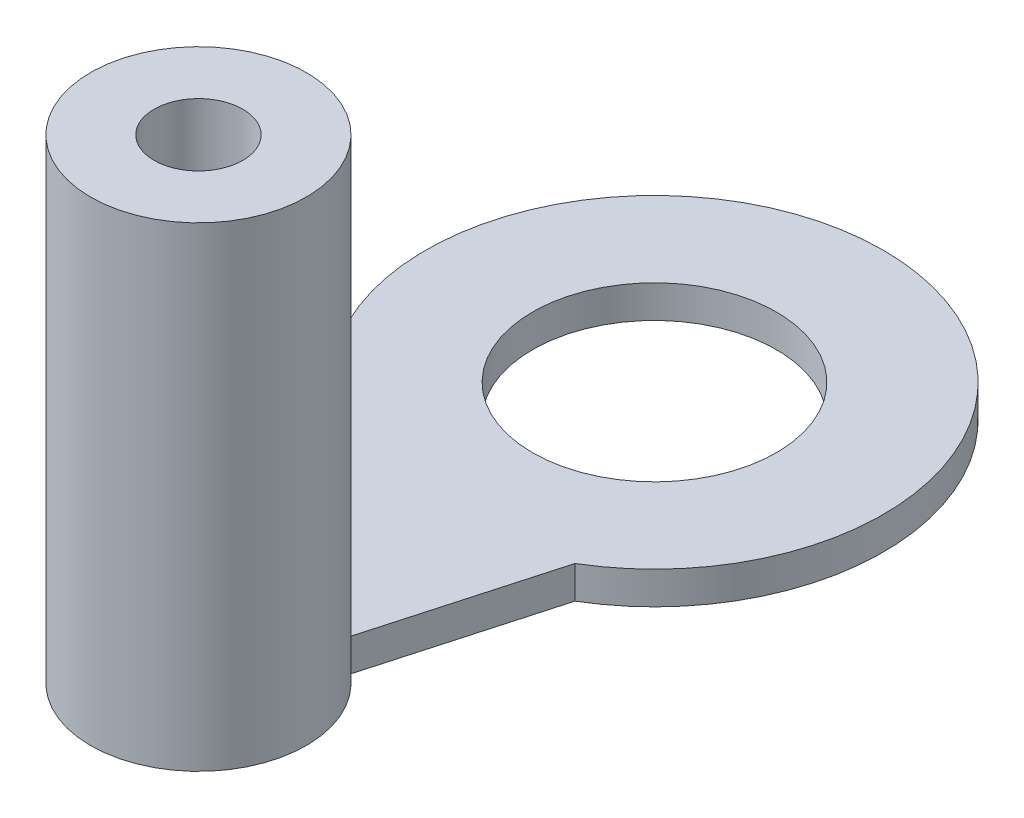
ISO-10303-21;
HEADER;
FILE_DESCRIPTION(('STEP AP214'),'2;1');
FILE_NAME('part.step','',(''),(''),'','','');
FILE_SCHEMA(('AUTOMOTIVE_DESIGN { 1 0 10303 214 1 1 1 1 }'));
ENDSEC;
DATA;
#1=APPLICATION_CONTEXT('core data for automotive mechanical design processes');
#2=APPLICATION_PROTOCOL_DEFINITION('international standard','automotive_design',2000,#1);
#3=PRODUCT_CONTEXT('',#1,'mechanical');
#4=PRODUCT('Part','Part','',(#3));
#5=PRODUCT_RELATED_PRODUCT_CATEGORY('part','',(#4));
#6=PRODUCT_DEFINITION_FORMATION('','',#4);
#7=PRODUCT_DEFINITION_CONTEXT('part definition',#1,'design');
#8=PRODUCT_DEFINITION('design','',#6,#7);
#9=PRODUCT_DEFINITION_SHAPE('','',#8);
#10=(LENGTH_UNIT() NAMED_UNIT(*) SI_UNIT(.MILLI.,.METRE.));
#11=(NAMED_UNIT(*) PLANE_ANGLE_UNIT() SI_UNIT($,.RADIAN.));
#12=(NAMED_UNIT(*) SI_UNIT($,.STERADIAN.) SOLID_ANGLE_UNIT());
#13=UNCERTAINTY_MEASURE_WITH_UNIT(LENGTH_MEASURE(1.E-05),#10,'distance_accuracy_value','');
#14=(GEOMETRIC_REPRESENTATION_CONTEXT(3) GLOBAL_UNCERTAINTY_ASSIGNED_CONTEXT((#13)) GLOBAL_UNIT_ASSIGNED_CONTEXT((#10,
#11,#12)) REPRESENTATION_CONTEXT('',''));
#15=CARTESIAN_POINT('',(0.,0.,0.));
#16=DIRECTION('',(0.,0.,1.));
#17=DIRECTION('',(1.,0.,0.));
#18=AXIS2_PLACEMENT_3D('',#15,#16,#17);
#19=CARTESIAN_POINT('',(0.,0.85,0.));
#20=DIRECTION('',(0.,-1.,0.));
#21=DIRECTION('',(0.,0.,-1.));
#22=AXIS2_PLACEMENT_3D('',#19,#20,#21);
#23=CYLINDRICAL_SURFACE('',#22,5.96);
#24=CARTESIAN_POINT('',(0.,0.,0.));
#25=DIRECTION('',(0.,1.,0.));
#26=DIRECTION('',(0.,0.,1.));
#27=AXIS2_PLACEMENT_3D('',#24,#25,#26);
#28=CIRCLE('',#27,5.96);
#29=CARTESIAN_POINT('',(3.04994252992994,0.,5.12049319539872));
#30=VERTEX_POINT('',#29);
#31=CARTESIAN_POINT('',(-3.03699348450103,0.,5.1281839451309));
#32=VERTEX_POINT('',#31);
#33=EDGE_CURVE('E95',#30,#32,#28,.T.);
#34=ORIENTED_EDGE('',*,*,#33,.T.);
#35=DIRECTION('',(0.,1.,0.));
#36=VECTOR('',#35,1.);
#37=CARTESIAN_POINT('',(-3.03699348450103,-9.09253277240075,5.1281839451309));
#38=LINE('',#37,#36);
#39=CARTESIAN_POINT('',(-3.03699348450103,0.85,5.1281839451309));
#40=VERTEX_POINT('',#39);
#41=EDGE_CURVE('E50',#32,#40,#38,.T.);
#42=ORIENTED_EDGE('',*,*,#41,.T.);
#43=CARTESIAN_POINT('',(0.,0.85,0.));
#44=DIRECTION('',(0.,1.,0.));
#45=DIRECTION('',(0.,0.,1.));
#46=AXIS2_PLACEMENT_3D('',#43,#44,#45);
#47=CIRCLE('',#46,5.96);
#48=CARTESIAN_POINT('',(3.04994252992994,0.85,5.12049319539872));
#49=VERTEX_POINT('',#48);
#50=EDGE_CURVE('E43',#49,#40,#47,.T.);
#51=ORIENTED_EDGE('',*,*,#50,.F.);
#52=DIRECTION('',(0.,1.,0.));
#53=VECTOR('',#52,1.);
#54=CARTESIAN_POINT('',(3.04994252992994,-9.09253277240075,5.12049319539872));
#55=LINE('',#54,#53);
#56=EDGE_CURVE('E105',#30,#49,#55,.T.);
#57=ORIENTED_EDGE('',*,*,#56,.F.);
#58=EDGE_LOOP('',(#34,#42,#51,#57));
#59=FACE_BOUND('',#58,.T.);
#60=ADVANCED_FACE('F36',(#59),#23,.T.);
#61=CARTESIAN_POINT('',(0.,0.85,0.));
#62=DIRECTION('',(0.,1.,0.));
#63=DIRECTION('',(0.,0.,1.));
#64=AXIS2_PLACEMENT_3D('',#61,#62,#63);
#65=PLANE('',#64);
#66=CARTESIAN_POINT('',(0.,0.85,11.875));
#67=DIRECTION('',(0.,1.,0.));
#68=DIRECTION('',(0.,0.,1.));
#69=AXIS2_PLACEMENT_3D('',#66,#67,#68);
#70=CIRCLE('',#69,2.81);
#71=CARTESIAN_POINT('',(1.76778572364162,0.85,9.69073041149017));
#72=VERTEX_POINT('',#71);
#73=CARTESIAN_POINT('',(-1.76493477781305,0.85,9.68842614346874));
#74=VERTEX_POINT('',#73);
#75=EDGE_CURVE('E85',#72,#74,#70,.T.);
#76=ORIENTED_EDGE('',*,*,#75,.F.);
#77=DIRECTION('',(0.270116406483893,0.,-0.962827672508548));
#78=VECTOR('',#77,1.);
#79=CARTESIAN_POINT('',(1.155,0.85,11.875));
#80=LINE('',#79,#78);
#81=EDGE_CURVE('E57',#72,#49,#80,.T.);
#82=ORIENTED_EDGE('',*,*,#81,.T.);
#83=ORIENTED_EDGE('',*,*,#50,.T.);
#84=DIRECTION('',(0.268687851400259,0.,0.963227303656781));
#85=VECTOR('',#84,1.);
#86=CARTESIAN_POINT('',(-1.155,0.85,11.875));
#87=LINE('',#86,#85);
#88=EDGE_CURVE('E114',#40,#74,#87,.T.);
#89=ORIENTED_EDGE('',*,*,#88,.T.);
#90=EDGE_LOOP('',(#76,#82,#83,#89));
#91=FACE_BOUND('',#90,.T.);
#92=CARTESIAN_POINT('',(0.,0.85,0.));
#93=DIRECTION('',(0.,1.,0.));
#94=DIRECTION('',(0.,0.,1.));
#95=AXIS2_PLACEMENT_3D('',#92,#93,#94);
#96=CIRCLE('',#95,3.175);
#97=CARTESIAN_POINT('',(0.,0.85,3.175));
#98=VERTEX_POINT('',#97);
#99=EDGE_CURVE('E97',#98,#98,#96,.T.);
#100=ORIENTED_EDGE('',*,*,#99,.F.);
#101=EDGE_LOOP('',(#100));
#102=FACE_BOUND('',#101,.T.);
#103=ADVANCED_FACE('F141',(#91,#102),#65,.T.);
#104=CARTESIAN_POINT('',(0.,0.,0.));
#105=DIRECTION('',(0.,1.,0.));
#106=DIRECTION('',(0.,0.,1.));
#107=AXIS2_PLACEMENT_3D('',#104,#105,#106);
#108=PLANE('',#107);
#109=CARTESIAN_POINT('',(0.,0.,0.));
#110=DIRECTION('',(0.,1.,0.));
#111=DIRECTION('',(0.,0.,1.));
#112=AXIS2_PLACEMENT_3D('',#109,#110,#111);
#113=CIRCLE('',#112,3.175);
#114=CARTESIAN_POINT('',(0.,0.,3.175));
#115=VERTEX_POINT('',#114);
#116=EDGE_CURVE('E101',#115,#115,#113,.T.);
#117=ORIENTED_EDGE('',*,*,#116,.T.);
#118=EDGE_LOOP('',(#117));
#119=FACE_BOUND('',#118,.T.);
#120=DIRECTION('',(-0.270116406483893,0.,0.962827672508548));
#121=VECTOR('',#120,1.);
#122=CARTESIAN_POINT('',(1.155,0.,11.875));
#123=LINE('',#122,#121);
#124=CARTESIAN_POINT('',(1.76778572364162,0.,9.69073041149017));
#125=VERTEX_POINT('',#124);
#126=EDGE_CURVE('E92',#30,#125,#123,.T.);
#127=ORIENTED_EDGE('',*,*,#126,.T.);
#128=CARTESIAN_POINT('',(0.,0.,11.875));
#129=DIRECTION('',(0.,1.,0.));
#130=DIRECTION('',(0.,0.,1.));
#131=AXIS2_PLACEMENT_3D('',#128,#129,#130);
#132=CIRCLE('',#131,2.81);
#133=CARTESIAN_POINT('',(-1.76493477781305,0.,9.68842614346874));
#134=VERTEX_POINT('',#133);
#135=EDGE_CURVE('E76',#134,#125,#132,.T.);
#136=ORIENTED_EDGE('',*,*,#135,.F.);
#137=DIRECTION('',(-0.268687851400259,0.,-0.963227303656781));
#138=VECTOR('',#137,1.);
#139=CARTESIAN_POINT('',(-1.155,0.,11.875));
#140=LINE('',#139,#138);
#141=EDGE_CURVE('E98',#134,#32,#140,.T.);
#142=ORIENTED_EDGE('',*,*,#141,.T.);
#143=ORIENTED_EDGE('',*,*,#33,.F.);
#144=EDGE_LOOP('',(#127,#136,#142,#143));
#145=FACE_BOUND('',#144,.T.);
#146=CARTESIAN_POINT('',(0.,0.,11.875));
#147=DIRECTION('',(0.,1.,0.));
#148=DIRECTION('',(0.,0.,1.));
#149=AXIS2_PLACEMENT_3D('',#146,#147,#148);
#150=CIRCLE('',#149,1.155);
#151=CARTESIAN_POINT('',(0.,0.,13.03));
#152=VERTEX_POINT('',#151);
#153=EDGE_CURVE('E86',#152,#152,#150,.T.);
#154=ORIENTED_EDGE('',*,*,#153,.T.);
#155=EDGE_LOOP('',(#154));
#156=FACE_BOUND('',#155,.T.);
#157=ADVANCED_FACE('F93',(#119,#145,#156),#108,.F.);
#158=CARTESIAN_POINT('',(0.,0.85,0.));
#159=DIRECTION('',(0.,1.,0.));
#160=DIRECTION('',(0.,0.,1.));
#161=AXIS2_PLACEMENT_3D('',#158,#159,#160);
#162=CYLINDRICAL_SURFACE('',#161,3.175);
#163=ORIENTED_EDGE('',*,*,#116,.F.);
#164=EDGE_LOOP('',(#163));
#165=FACE_BOUND('',#164,.T.);
#166=ORIENTED_EDGE('',*,*,#99,.T.);
#167=EDGE_LOOP('',(#166));
#168=FACE_BOUND('',#167,.T.);
#169=ADVANCED_FACE('F149',(#165,#168),#162,.F.);
#170=CARTESIAN_POINT('',(-1.155,-9.09253277240075,11.875));
#171=DIRECTION('',(-0.963227303656781,0.,0.268687851400259));
#172=DIRECTION('',(0.268687851400259,0.,0.963227303656781));
#173=AXIS2_PLACEMENT_3D('',#170,#171,#172);
#174=PLANE('',#173);
#175=DIRECTION('',(0.,1.,0.));
#176=VECTOR('',#175,1.);
#177=CARTESIAN_POINT('',(-1.76493477781305,0.,9.68842614346874));
#178=LINE('',#177,#176);
#179=EDGE_CURVE('E81',#74,#134,#178,.F.);
#180=ORIENTED_EDGE('',*,*,#179,.F.);
#181=ORIENTED_EDGE('',*,*,#88,.F.);
#182=ORIENTED_EDGE('',*,*,#41,.F.);
#183=ORIENTED_EDGE('',*,*,#141,.F.);
#184=EDGE_LOOP('',(#180,#181,#182,#183));
#185=FACE_BOUND('',#184,.T.);
#186=ADVANCED_FACE('F112',(#185),#174,.T.);
#187=CARTESIAN_POINT('',(1.155,-9.09253277240075,11.875));
#188=DIRECTION('',(0.962827672508548,0.,0.270116406483893));
#189=DIRECTION('',(0.270116406483893,0.,-0.962827672508548));
#190=AXIS2_PLACEMENT_3D('',#187,#188,#189);
#191=PLANE('',#190);
#192=DIRECTION('',(0.,1.,0.));
#193=VECTOR('',#192,1.);
#194=CARTESIAN_POINT('',(1.76778572364162,0.,9.69073041149017));
#195=LINE('',#194,#193);
#196=EDGE_CURVE('E11',#125,#72,#195,.T.);
#197=ORIENTED_EDGE('',*,*,#196,.F.);
#198=ORIENTED_EDGE('',*,*,#126,.F.);
#199=ORIENTED_EDGE('',*,*,#56,.T.);
#200=ORIENTED_EDGE('',*,*,#81,.F.);
#201=EDGE_LOOP('',(#197,#198,#199,#200));
#202=FACE_BOUND('',#201,.T.);
#203=ADVANCED_FACE('F90',(#202),#191,.T.);
#204=CARTESIAN_POINT('',(0.,0.,11.875));
#205=DIRECTION('',(0.,1.,0.));
#206=DIRECTION('',(0.,0.,1.));
#207=AXIS2_PLACEMENT_3D('',#204,#205,#206);
#208=CYLINDRICAL_SURFACE('',#207,2.81);
#209=ORIENTED_EDGE('',*,*,#75,.T.);
#210=ORIENTED_EDGE('',*,*,#179,.T.);
#211=ORIENTED_EDGE('',*,*,#135,.T.);
#212=ORIENTED_EDGE('',*,*,#196,.T.);
#213=EDGE_LOOP('',(#209,#210,#211,#212));
#214=FACE_BOUND('',#213,.T.);
#215=CARTESIAN_POINT('',(0.,12.37,11.875));
#216=DIRECTION('',(0.,1.,0.));
#217=DIRECTION('',(0.,0.,1.));
#218=AXIS2_PLACEMENT_3D('',#215,#216,#217);
#219=CIRCLE('',#218,2.81);
#220=CARTESIAN_POINT('',(0.,12.37,14.685));
#221=VERTEX_POINT('',#220);
#222=EDGE_CURVE('E122',#221,#221,#219,.T.);
#223=ORIENTED_EDGE('',*,*,#222,.F.);
#224=EDGE_LOOP('',(#223));
#225=FACE_BOUND('',#224,.T.);
#226=ADVANCED_FACE('F78',(#214,#225),#208,.T.);
#227=CARTESIAN_POINT('',(0.,0.,11.875));
#228=DIRECTION('',(0.,1.,0.));
#229=DIRECTION('',(0.,0.,1.));
#230=AXIS2_PLACEMENT_3D('',#227,#228,#229);
#231=CYLINDRICAL_SURFACE('',#230,1.155);
#232=ORIENTED_EDGE('',*,*,#153,.F.);
#233=EDGE_LOOP('',(#232));
#234=FACE_BOUND('',#233,.T.);
#235=CARTESIAN_POINT('',(0.,12.37,11.875));
#236=DIRECTION('',(0.,1.,0.));
#237=DIRECTION('',(0.,0.,1.));
#238=AXIS2_PLACEMENT_3D('',#235,#236,#237);
#239=CIRCLE('',#238,1.155);
#240=CARTESIAN_POINT('',(0.,12.37,13.03));
#241=VERTEX_POINT('',#240);
#242=EDGE_CURVE('E125',#241,#241,#239,.T.);
#243=ORIENTED_EDGE('',*,*,#242,.T.);
#244=EDGE_LOOP('',(#243));
#245=FACE_BOUND('',#244,.T.);
#246=ADVANCED_FACE('F129',(#234,#245),#231,.F.);
#247=CARTESIAN_POINT('',(0.,12.37,11.875));
#248=DIRECTION('',(0.,1.,0.));
#249=DIRECTION('',(0.,0.,1.));
#250=AXIS2_PLACEMENT_3D('',#247,#248,#249);
#251=PLANE('',#250);
#252=ORIENTED_EDGE('',*,*,#222,.T.);
#253=EDGE_LOOP('',(#252));
#254=FACE_BOUND('',#253,.T.);
#255=ORIENTED_EDGE('',*,*,#242,.F.);
#256=EDGE_LOOP('',(#255));
#257=FACE_BOUND('',#256,.T.);
#258=ADVANCED_FACE('F131',(#254,#257),#251,.T.);
#259=CLOSED_SHELL('',(#60,#103,#157,#169,#186,#203,#226,#246,#258));
#260=MANIFOLD_SOLID_BREP('B2',#259);
#261=ADVANCED_BREP_SHAPE_REPRESENTATION('',(#18,#260),#14);
#262=SHAPE_DEFINITION_REPRESENTATION(#9,#261);
ENDSEC;
END-ISO-10303-21;
